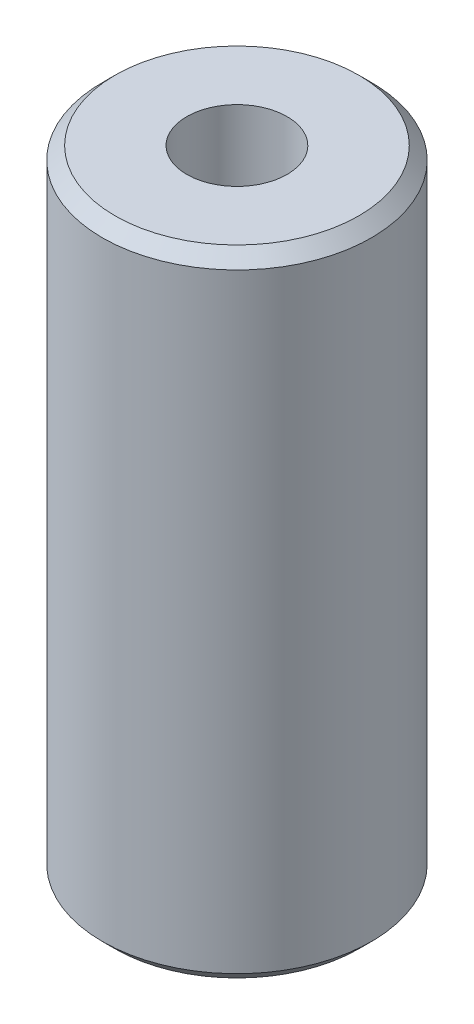
ISO-10303-21;
HEADER;
FILE_DESCRIPTION(('STEP AP214'),'2;1');
FILE_NAME('part.step','',(''),(''),'','','');
FILE_SCHEMA(('AUTOMOTIVE_DESIGN { 1 0 10303 214 1 1 1 1 }'));
ENDSEC;
DATA;
#1=APPLICATION_CONTEXT('core data for automotive mechanical design processes');
#2=APPLICATION_PROTOCOL_DEFINITION('international standard','automotive_design',2000,#1);
#3=PRODUCT_CONTEXT('',#1,'mechanical');
#4=PRODUCT('Part','Part','',(#3));
#5=PRODUCT_RELATED_PRODUCT_CATEGORY('part','',(#4));
#6=PRODUCT_DEFINITION_FORMATION('','',#4);
#7=PRODUCT_DEFINITION_CONTEXT('part definition',#1,'design');
#8=PRODUCT_DEFINITION('design','',#6,#7);
#9=PRODUCT_DEFINITION_SHAPE('','',#8);
#10=(LENGTH_UNIT() NAMED_UNIT(*) SI_UNIT(.MILLI.,.METRE.));
#11=(NAMED_UNIT(*) PLANE_ANGLE_UNIT() SI_UNIT($,.RADIAN.));
#12=(NAMED_UNIT(*) SI_UNIT($,.STERADIAN.) SOLID_ANGLE_UNIT());
#13=UNCERTAINTY_MEASURE_WITH_UNIT(LENGTH_MEASURE(1.E-05),#10,'distance_accuracy_value','');
#14=(GEOMETRIC_REPRESENTATION_CONTEXT(3) GLOBAL_UNCERTAINTY_ASSIGNED_CONTEXT((#13)) GLOBAL_UNIT_ASSIGNED_CONTEXT((#10,
#11,#12)) REPRESENTATION_CONTEXT('',''));
#15=CARTESIAN_POINT('',(0.,0.,0.));
#16=DIRECTION('',(0.,0.,1.));
#17=DIRECTION('',(1.,0.,0.));
#18=AXIS2_PLACEMENT_3D('',#15,#16,#17);
#19=CARTESIAN_POINT('',(0.,247.697142782354,0.));
#20=DIRECTION('',(0.,-1.,0.));
#21=DIRECTION('',(0.,0.,-1.));
#22=AXIS2_PLACEMENT_3D('',#19,#20,#21);
#23=CYLINDRICAL_SURFACE('',#22,52.5);
#24=CARTESIAN_POINT('',(0.,242.751745645589,0.));
#25=DIRECTION('',(0.,1.,0.));
#26=DIRECTION('',(0.,0.,1.));
#27=AXIS2_PLACEMENT_3D('',#24,#25,#26);
#28=CIRCLE('',#27,52.5);
#29=CARTESIAN_POINT('',(0.,242.751745645589,52.5));
#30=VERTEX_POINT('',#29);
#31=EDGE_CURVE('E50',#30,#30,#28,.F.);
#32=ORIENTED_EDGE('',*,*,#31,.T.);
#33=EDGE_LOOP('',(#32));
#34=FACE_BOUND('',#33,.T.);
#35=CARTESIAN_POINT('',(0.,4.94539713676453,0.));
#36=DIRECTION('',(0.,1.,0.));
#37=DIRECTION('',(0.,0.,1.));
#38=AXIS2_PLACEMENT_3D('',#35,#36,#37);
#39=CIRCLE('',#38,52.5);
#40=CARTESIAN_POINT('',(0.,4.94539713676453,52.5));
#41=VERTEX_POINT('',#40);
#42=EDGE_CURVE('E51',#41,#41,#39,.T.);
#43=ORIENTED_EDGE('',*,*,#42,.T.);
#44=EDGE_LOOP('',(#43));
#45=FACE_BOUND('',#44,.T.);
#46=ADVANCED_FACE('F39',(#34,#45),#23,.T.);
#47=CARTESIAN_POINT('',(0.,247.697142782354,0.));
#48=DIRECTION('',(0.,1.,0.));
#49=DIRECTION('',(0.,0.,1.));
#50=AXIS2_PLACEMENT_3D('',#47,#48,#49);
#51=PLANE('',#50);
#52=CARTESIAN_POINT('',(0.,247.697142782354,0.));
#53=DIRECTION('',(0.,1.,0.));
#54=DIRECTION('',(0.,0.,1.));
#55=AXIS2_PLACEMENT_3D('',#52,#53,#54);
#56=CIRCLE('',#55,47.5546028632355);
#57=CARTESIAN_POINT('',(0.,247.697142782354,47.5546028632355));
#58=VERTEX_POINT('',#57);
#59=EDGE_CURVE('E54',#58,#58,#56,.T.);
#60=ORIENTED_EDGE('',*,*,#59,.T.);
#61=EDGE_LOOP('',(#60));
#62=FACE_BOUND('',#61,.T.);
#63=CARTESIAN_POINT('',(0.,247.697142782354,0.));
#64=DIRECTION('',(0.,1.,0.));
#65=DIRECTION('',(0.,0.,1.));
#66=AXIS2_PLACEMENT_3D('',#63,#64,#65);
#67=CIRCLE('',#66,19.5682997982654);
#68=CARTESIAN_POINT('',(0.,247.697142782354,19.5682997982654));
#69=VERTEX_POINT('',#68);
#70=EDGE_CURVE('E58',#69,#69,#67,.T.);
#71=ORIENTED_EDGE('',*,*,#70,.F.);
#72=EDGE_LOOP('',(#71));
#73=FACE_BOUND('',#72,.T.);
#74=ADVANCED_FACE('F69',(#62,#73),#51,.T.);
#75=CARTESIAN_POINT('',(0.,0.,0.));
#76=DIRECTION('',(0.,1.,0.));
#77=DIRECTION('',(0.,0.,1.));
#78=AXIS2_PLACEMENT_3D('',#75,#76,#77);
#79=PLANE('',#78);
#80=CARTESIAN_POINT('',(0.,0.,0.));
#81=DIRECTION('',(0.,1.,0.));
#82=DIRECTION('',(0.,0.,1.));
#83=AXIS2_PLACEMENT_3D('',#80,#81,#82);
#84=CIRCLE('',#83,47.5546028632354);
#85=CARTESIAN_POINT('',(0.,0.,47.5546028632354));
#86=VERTEX_POINT('',#85);
#87=EDGE_CURVE('E10',#86,#86,#84,.F.);
#88=ORIENTED_EDGE('',*,*,#87,.T.);
#89=EDGE_LOOP('',(#88));
#90=FACE_BOUND('',#89,.T.);
#91=CARTESIAN_POINT('',(0.,0.,0.));
#92=DIRECTION('',(0.,1.,0.));
#93=DIRECTION('',(0.,0.,1.));
#94=AXIS2_PLACEMENT_3D('',#91,#92,#93);
#95=CIRCLE('',#94,19.5682997982654);
#96=CARTESIAN_POINT('',(0.,0.,19.5682997982654));
#97=VERTEX_POINT('',#96);
#98=EDGE_CURVE('E63',#97,#97,#95,.T.);
#99=ORIENTED_EDGE('',*,*,#98,.T.);
#100=EDGE_LOOP('',(#99));
#101=FACE_BOUND('',#100,.T.);
#102=ADVANCED_FACE('F75',(#90,#101),#79,.F.);
#103=CARTESIAN_POINT('',(0.,247.697142782354,0.));
#104=DIRECTION('',(0.,-1.,0.));
#105=DIRECTION('',(0.,0.,-1.));
#106=AXIS2_PLACEMENT_3D('',#103,#104,#105);
#107=CYLINDRICAL_SURFACE('',#106,19.5682997982654);
#108=ORIENTED_EDGE('',*,*,#70,.T.);
#109=EDGE_LOOP('',(#108));
#110=FACE_BOUND('',#109,.T.);
#111=ORIENTED_EDGE('',*,*,#98,.F.);
#112=EDGE_LOOP('',(#111));
#113=FACE_BOUND('',#112,.T.);
#114=ADVANCED_FACE('F70',(#110,#113),#107,.F.);
#115=CARTESIAN_POINT('',(0.,247.697142782354,0.));
#116=DIRECTION('',(0.,-1.,0.));
#117=DIRECTION('',(0.,0.,-1.));
#118=AXIS2_PLACEMENT_3D('',#115,#116,#117);
#119=CONICAL_SURFACE('',#118,47.5546028632355,0.78539816339745);
#120=ORIENTED_EDGE('',*,*,#31,.F.);
#121=EDGE_LOOP('',(#120));
#122=FACE_BOUND('',#121,.T.);
#123=ORIENTED_EDGE('',*,*,#59,.F.);
#124=EDGE_LOOP('',(#123));
#125=FACE_BOUND('',#124,.T.);
#126=ADVANCED_FACE('F81',(#122,#125),#119,.T.);
#127=CARTESIAN_POINT('',(0.,4.94539713676453,0.));
#128=DIRECTION('',(0.,1.,0.));
#129=DIRECTION('',(0.,0.,1.));
#130=AXIS2_PLACEMENT_3D('',#127,#128,#129);
#131=CONICAL_SURFACE('',#130,52.5,0.785398163397452);
#132=CARTESIAN_POINT('',(0.,0.,47.5546028632354));
#133=CARTESIAN_POINT('',(0.,0.0515145535079631,47.6061174167434));
#134=CARTESIAN_POINT('',(0.,0.103029107015927,47.6576319702514));
#135=CARTESIAN_POINT('',(0.,0.206058214031855,47.7606610772673));
#136=CARTESIAN_POINT('',(0.,0.257572767539819,47.8121756307753));
#137=CARTESIAN_POINT('',(0.,0.360601874555746,47.9152047377912));
#138=CARTESIAN_POINT('',(0.,0.41211642806371,47.9667192912991));
#139=CARTESIAN_POINT('',(0.,0.515145535079638,48.0697483983151));
#140=CARTESIAN_POINT('',(0.,0.566660088587602,48.121262951823));
#141=CARTESIAN_POINT('',(0.,0.66968919560353,48.224292058839));
#142=CARTESIAN_POINT('',(0.,0.721203749111494,48.2758066123469));
#143=CARTESIAN_POINT('',(0.,0.824232856127421,48.3788357193629));
#144=CARTESIAN_POINT('',(0.,0.875747409635385,48.4303502728708));
#145=CARTESIAN_POINT('',(0.,0.978776516651313,48.5333793798867));
#146=CARTESIAN_POINT('',(0.,1.03029107015928,48.5848939333947));
#147=CARTESIAN_POINT('',(0.,1.1333201771752,48.6879230404106));
#148=CARTESIAN_POINT('',(0.,1.18483473068317,48.7394375939186));
#149=CARTESIAN_POINT('',(0.,1.2878638376991,48.8424667009345));
#150=CARTESIAN_POINT('',(0.,1.33937839120706,48.8939812544425));
#151=CARTESIAN_POINT('',(0.,1.44240749822299,48.9970103614584));
#152=CARTESIAN_POINT('',(0.,1.49392205173095,49.0485249149664));
#153=CARTESIAN_POINT('',(0.,1.59695115874688,49.1515540219823));
#154=CARTESIAN_POINT('',(0.,1.64846571225484,49.2030685754903));
#155=CARTESIAN_POINT('',(0.,1.75149481927077,49.3060976825062));
#156=CARTESIAN_POINT('',(0.,1.80300937277874,49.3576122360142));
#157=CARTESIAN_POINT('',(0.,1.90603847979466,49.4606413430301));
#158=CARTESIAN_POINT('',(0.,1.95755303330263,49.5121558965381));
#159=CARTESIAN_POINT('',(0.,2.06058214031856,49.615185003554));
#160=CARTESIAN_POINT('',(0.,2.11209669382652,49.666699557062));
#161=CARTESIAN_POINT('',(0.,2.21512580084245,49.7697286640779));
#162=CARTESIAN_POINT('',(0.,2.26664035435041,49.8212432175859));
#163=CARTESIAN_POINT('',(0.,2.36966946136634,49.9242723246018));
#164=CARTESIAN_POINT('',(0.,2.4211840148743,49.9757868781097));
#165=CARTESIAN_POINT('',(0.,2.52421312189023,50.0788159851257));
#166=CARTESIAN_POINT('',(0.,2.57572767539819,50.1303305386336));
#167=CARTESIAN_POINT('',(0.,2.67875678241412,50.2333596456496));
#168=CARTESIAN_POINT('',(0.,2.73027133592209,50.2848741991575));
#169=CARTESIAN_POINT('',(0.,2.83330044293801,50.3879033061735));
#170=CARTESIAN_POINT('',(0.,2.88481499644598,50.4394178596814));
#171=CARTESIAN_POINT('',(0.,2.98784410346191,50.5424469666974));
#172=CARTESIAN_POINT('',(0.,3.03935865696987,50.5939615202053));
#173=CARTESIAN_POINT('',(0.,3.1423877639858,50.6969906272212));
#174=CARTESIAN_POINT('',(0.,3.19390231749376,50.7485051807292));
#175=CARTESIAN_POINT('',(0.,3.29693142450969,50.8515342877451));
#176=CARTESIAN_POINT('',(0.,3.34844597801765,50.9030488412531));
#177=CARTESIAN_POINT('',(0.,3.45147508503358,51.006077948269));
#178=CARTESIAN_POINT('',(0.,3.50298963854154,51.057592501777));
#179=CARTESIAN_POINT('',(0.,3.60601874555747,51.1606216087929));
#180=CARTESIAN_POINT('',(0.,3.65753329906544,51.2121361623009));
#181=CARTESIAN_POINT('',(0.,3.76056240608136,51.3151652693168));
#182=CARTESIAN_POINT('',(0.,3.81207695958933,51.3666798228248));
#183=CARTESIAN_POINT('',(0.,3.91510606660526,51.4697089298407));
#184=CARTESIAN_POINT('',(0.,3.96662062011322,51.5212234833487));
#185=CARTESIAN_POINT('',(0.,4.06964972712915,51.6242525903646));
#186=CARTESIAN_POINT('',(0.,4.12116428063711,51.6757671438726));
#187=CARTESIAN_POINT('',(0.,4.22419338765304,51.7787962508885));
#188=CARTESIAN_POINT('',(0.,4.275707941161,51.8303108043965));
#189=CARTESIAN_POINT('',(0.,4.37873704817693,51.9333399114124));
#190=CARTESIAN_POINT('',(0.,4.43025160168489,51.9848544649204));
#191=CARTESIAN_POINT('',(0.,4.53328070870082,52.0878835719363));
#192=CARTESIAN_POINT('',(0.,4.58479526220879,52.1393981254443));
#193=CARTESIAN_POINT('',(0.,4.68782436922471,52.2424272324602));
#194=CARTESIAN_POINT('',(0.,4.73933892273268,52.2939417859681));
#195=CARTESIAN_POINT('',(0.,4.84236802974861,52.3969708929841));
#196=CARTESIAN_POINT('',(0.,4.89388258325657,52.448485446492));
#197=CARTESIAN_POINT('',(0.,4.94539713676453,52.5));
#198=B_SPLINE_CURVE_WITH_KNOTS('',3,(#132,#133,#134,#135,#136,#137,#138,#139,#140,#141,#142,
#143,#144,#145,#146,#147,#148,#149,#150,#151,#152,#153,#154,#155,#156,#157,#158,#159,#160,#161,
#162,#163,#164,#165,#166,#167,#168,#169,#170,#171,#172,#173,#174,#175,#176,#177,#178,#179,#180,
#181,#182,#183,#184,#185,#186,#187,#188,#189,#190,#191,#192,#193,#194,#195,#196,#197),
.UNSPECIFIED.,.F.,.F.,(4,2,2,2,2,2,2,2,2,2,2,2,2,2,2,2,2,2,2,2,2,2,2,2,2,2,2,2,2,2,2,2,4),(0.,
0.218557740691672,0.437115481383344,0.655673222075015,0.874230962766687,1.09278870345836,
1.31134644415003,1.5299041848417,1.74846192553337,1.96701966622505,2.18557740691672,
2.40413514760839,2.62269288830006,2.84125062899173,3.05980836968341,3.27836611037508,
3.49692385106675,3.71548159175842,3.93403933245009,4.15259707314176,4.37115481383344,
4.58971255452511,4.80827029521678,5.02682803590846,5.24538577660013,5.4639435172918,
5.68250125798347,5.90105899867514,6.11961673936681,6.33817448005848,6.55673222075016,
6.77528996144183,6.9938477021335),.UNSPECIFIED.);
#199=EDGE_CURVE('BSEAM45',#86,#41,#198,.T.);
#200=ORIENTED_EDGE('',*,*,#87,.F.);
#201=ORIENTED_EDGE('',*,*,#42,.F.);
#202=ORIENTED_EDGE('',*,*,#199,.T.);
#203=ORIENTED_EDGE('',*,*,#199,.F.);
#204=EDGE_LOOP('',(#200,#202,#201,#203));
#205=FACE_BOUND('',#204,.T.);
#206=ADVANCED_FACE('F45',(#205),#131,.T.);
#207=CLOSED_SHELL('',(#46,#74,#102,#114,#126,#206));
#208=MANIFOLD_SOLID_BREP('B2',#207);
#209=ADVANCED_BREP_SHAPE_REPRESENTATION('',(#18,#208),#14);
#210=SHAPE_DEFINITION_REPRESENTATION(#9,#209);
ENDSEC;
END-ISO-10303-21;
